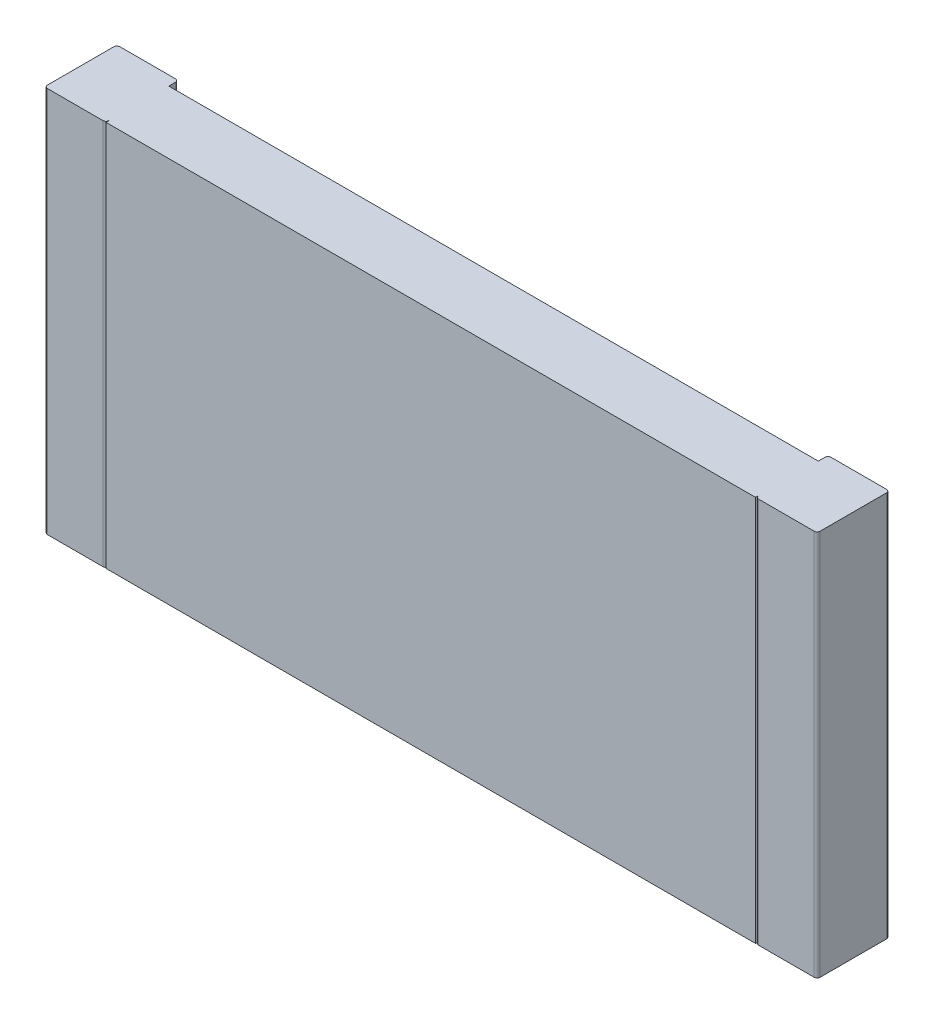
ISO-10303-21;
HEADER;
FILE_DESCRIPTION(('STEP AP214'),'2;1');
FILE_NAME('part.step','',(''),(''),'','','');
FILE_SCHEMA(('AUTOMOTIVE_DESIGN { 1 0 10303 214 1 1 1 1 }'));
ENDSEC;
DATA;
#1=APPLICATION_CONTEXT('core data for automotive mechanical design processes');
#2=APPLICATION_PROTOCOL_DEFINITION('international standard','automotive_design',2000,#1);
#3=PRODUCT_CONTEXT('',#1,'mechanical');
#4=PRODUCT('Part','Part','',(#3));
#5=PRODUCT_RELATED_PRODUCT_CATEGORY('part','',(#4));
#6=PRODUCT_DEFINITION_FORMATION('','',#4);
#7=PRODUCT_DEFINITION_CONTEXT('part definition',#1,'design');
#8=PRODUCT_DEFINITION('design','',#6,#7);
#9=PRODUCT_DEFINITION_SHAPE('','',#8);
#10=(LENGTH_UNIT() NAMED_UNIT(*) SI_UNIT(.MILLI.,.METRE.));
#11=(NAMED_UNIT(*) PLANE_ANGLE_UNIT() SI_UNIT($,.RADIAN.));
#12=(NAMED_UNIT(*) SI_UNIT($,.STERADIAN.) SOLID_ANGLE_UNIT());
#13=UNCERTAINTY_MEASURE_WITH_UNIT(LENGTH_MEASURE(1.E-05),#10,'distance_accuracy_value','');
#14=(GEOMETRIC_REPRESENTATION_CONTEXT(3) GLOBAL_UNCERTAINTY_ASSIGNED_CONTEXT((#13)) GLOBAL_UNIT_ASSIGNED_CONTEXT((#10,
#11,#12)) REPRESENTATION_CONTEXT('',''));
#15=CARTESIAN_POINT('',(0.,0.,0.));
#16=DIRECTION('',(0.,0.,1.));
#17=DIRECTION('',(1.,0.,0.));
#18=AXIS2_PLACEMENT_3D('',#15,#16,#17);
#19=CARTESIAN_POINT('',(-3.175,-1.6,0.575));
#20=DIRECTION('',(0.,1.,0.));
#21=DIRECTION('',(0.,0.,1.));
#22=AXIS2_PLACEMENT_3D('',#19,#20,#21);
#23=CYLINDRICAL_SURFACE('',#22,0.025);
#24=CARTESIAN_POINT('',(-3.175,1.6,0.575));
#25=DIRECTION('',(0.,1.,0.));
#26=DIRECTION('',(0.,0.,1.));
#27=AXIS2_PLACEMENT_3D('',#24,#25,#26);
#28=CIRCLE('',#27,0.025);
#29=CARTESIAN_POINT('',(-3.175,1.6,0.6));
#30=VERTEX_POINT('',#29);
#31=CARTESIAN_POINT('',(-3.2,1.6,0.575));
#32=VERTEX_POINT('',#31);
#33=EDGE_CURVE('E172',#30,#32,#28,.F.);
#34=ORIENTED_EDGE('',*,*,#33,.T.);
#35=DIRECTION('',(0.,1.,0.));
#36=VECTOR('',#35,1.);
#37=CARTESIAN_POINT('',(-3.2,-1.6,0.575));
#38=LINE('',#37,#36);
#39=CARTESIAN_POINT('',(-3.2,-1.6,0.575));
#40=VERTEX_POINT('',#39);
#41=EDGE_CURVE('E154',#32,#40,#38,.F.);
#42=ORIENTED_EDGE('',*,*,#41,.T.);
#43=CARTESIAN_POINT('',(-3.175,-1.6,0.575));
#44=DIRECTION('',(0.,1.,0.));
#45=DIRECTION('',(0.,0.,1.));
#46=AXIS2_PLACEMENT_3D('',#43,#44,#45);
#47=CIRCLE('',#46,0.025);
#48=CARTESIAN_POINT('',(-3.175,-1.6,0.6));
#49=VERTEX_POINT('',#48);
#50=EDGE_CURVE('E20',#40,#49,#47,.T.);
#51=ORIENTED_EDGE('',*,*,#50,.T.);
#52=DIRECTION('',(0.,1.,0.));
#53=VECTOR('',#52,1.);
#54=CARTESIAN_POINT('',(-3.175,-1.6,0.6));
#55=LINE('',#54,#53);
#56=EDGE_CURVE('E186',#30,#49,#55,.F.);
#57=ORIENTED_EDGE('',*,*,#56,.F.);
#58=EDGE_LOOP('',(#34,#42,#51,#57));
#59=FACE_BOUND('',#58,.T.);
#60=ADVANCED_FACE('F17',(#59),#23,.T.);
#61=CARTESIAN_POINT('',(3.175,-1.6,0.575));
#62=DIRECTION('',(0.,1.,0.));
#63=DIRECTION('',(0.,0.,1.));
#64=AXIS2_PLACEMENT_3D('',#61,#62,#63);
#65=CYLINDRICAL_SURFACE('',#64,0.025);
#66=DIRECTION('',(0.,1.,0.));
#67=VECTOR('',#66,1.);
#68=CARTESIAN_POINT('',(3.175,-1.6,0.6));
#69=LINE('',#68,#67);
#70=CARTESIAN_POINT('',(3.175,-1.6,0.6));
#71=VERTEX_POINT('',#70);
#72=CARTESIAN_POINT('',(3.175,1.6,0.6));
#73=VERTEX_POINT('',#72);
#74=EDGE_CURVE('E161',#71,#73,#69,.T.);
#75=ORIENTED_EDGE('',*,*,#74,.F.);
#76=CARTESIAN_POINT('',(3.175,-1.6,0.575));
#77=DIRECTION('',(0.,1.,0.));
#78=DIRECTION('',(0.,0.,1.));
#79=AXIS2_PLACEMENT_3D('',#76,#77,#78);
#80=CIRCLE('',#79,0.025);
#81=CARTESIAN_POINT('',(3.2,-1.6,0.575));
#82=VERTEX_POINT('',#81);
#83=EDGE_CURVE('E223',#71,#82,#80,.T.);
#84=ORIENTED_EDGE('',*,*,#83,.T.);
#85=DIRECTION('',(0.,1.,0.));
#86=VECTOR('',#85,1.);
#87=CARTESIAN_POINT('',(3.2,-1.6,0.575));
#88=LINE('',#87,#86);
#89=CARTESIAN_POINT('',(3.2,1.6,0.575));
#90=VERTEX_POINT('',#89);
#91=EDGE_CURVE('E181',#90,#82,#88,.F.);
#92=ORIENTED_EDGE('',*,*,#91,.F.);
#93=CARTESIAN_POINT('',(3.175,1.6,0.575));
#94=DIRECTION('',(0.,1.,0.));
#95=DIRECTION('',(0.,0.,1.));
#96=AXIS2_PLACEMENT_3D('',#93,#94,#95);
#97=CIRCLE('',#96,0.025);
#98=EDGE_CURVE('E225',#90,#73,#97,.F.);
#99=ORIENTED_EDGE('',*,*,#98,.T.);
#100=EDGE_LOOP('',(#75,#84,#92,#99));
#101=FACE_BOUND('',#100,.T.);
#102=ADVANCED_FACE('F230',(#101),#65,.T.);
#103=CARTESIAN_POINT('',(-3.2,-1.6,0.6));
#104=DIRECTION('',(0.,0.,1.));
#105=DIRECTION('',(1.,0.,0.));
#106=AXIS2_PLACEMENT_3D('',#103,#104,#105);
#107=PLANE('',#106);
#108=DIRECTION('',(1.,0.,0.));
#109=VECTOR('',#108,1.);
#110=CARTESIAN_POINT('',(-3.2,-1.6,0.6));
#111=LINE('',#110,#109);
#112=CARTESIAN_POINT('',(-2.715,-1.6,0.6));
#113=VERTEX_POINT('',#112);
#114=EDGE_CURVE('E168',#49,#113,#111,.T.);
#115=ORIENTED_EDGE('',*,*,#114,.T.);
#116=DIRECTION('',(0.,1.,0.));
#117=VECTOR('',#116,1.);
#118=CARTESIAN_POINT('',(-2.715,-1.6,0.6));
#119=LINE('',#118,#117);
#120=CARTESIAN_POINT('',(-2.715,1.6,0.6));
#121=VERTEX_POINT('',#120);
#122=EDGE_CURVE('E220',#121,#113,#119,.F.);
#123=ORIENTED_EDGE('',*,*,#122,.F.);
#124=DIRECTION('',(1.,0.,0.));
#125=VECTOR('',#124,1.);
#126=CARTESIAN_POINT('',(-3.2,1.6,0.6));
#127=LINE('',#126,#125);
#128=EDGE_CURVE('E188',#121,#30,#127,.F.);
#129=ORIENTED_EDGE('',*,*,#128,.T.);
#130=ORIENTED_EDGE('',*,*,#56,.T.);
#131=EDGE_LOOP('',(#115,#123,#129,#130));
#132=FACE_BOUND('',#131,.T.);
#133=ADVANCED_FACE('F253',(#132),#107,.T.);
#134=CARTESIAN_POINT('',(2.69,-1.6,0.6));
#135=DIRECTION('',(0.,0.,1.));
#136=DIRECTION('',(1.,0.,0.));
#137=AXIS2_PLACEMENT_3D('',#134,#135,#136);
#138=PLANE('',#137);
#139=DIRECTION('',(1.,0.,0.));
#140=VECTOR('',#139,1.);
#141=CARTESIAN_POINT('',(2.69,-1.6,0.6));
#142=LINE('',#141,#140);
#143=CARTESIAN_POINT('',(2.715,-1.6,0.6));
#144=VERTEX_POINT('',#143);
#145=EDGE_CURVE('E185',#144,#71,#142,.T.);
#146=ORIENTED_EDGE('',*,*,#145,.T.);
#147=ORIENTED_EDGE('',*,*,#74,.T.);
#148=DIRECTION('',(1.,0.,0.));
#149=VECTOR('',#148,1.);
#150=CARTESIAN_POINT('',(2.69,1.6,0.6));
#151=LINE('',#150,#149);
#152=CARTESIAN_POINT('',(2.715,1.6,0.6));
#153=VERTEX_POINT('',#152);
#154=EDGE_CURVE('E237',#73,#153,#151,.F.);
#155=ORIENTED_EDGE('',*,*,#154,.T.);
#156=DIRECTION('',(0.,1.,0.));
#157=VECTOR('',#156,1.);
#158=CARTESIAN_POINT('',(2.715,-1.6,0.6));
#159=LINE('',#158,#157);
#160=EDGE_CURVE('E215',#144,#153,#159,.T.);
#161=ORIENTED_EDGE('',*,*,#160,.F.);
#162=EDGE_LOOP('',(#146,#147,#155,#161));
#163=FACE_BOUND('',#162,.T.);
#164=ADVANCED_FACE('F235',(#163),#138,.T.);
#165=CARTESIAN_POINT('',(-3.2,-1.6,0.));
#166=DIRECTION('',(1.,0.,0.));
#167=DIRECTION('',(0.,0.,-1.));
#168=AXIS2_PLACEMENT_3D('',#165,#166,#167);
#169=PLANE('',#168);
#170=DIRECTION('',(0.,0.,-1.));
#171=VECTOR('',#170,1.);
#172=CARTESIAN_POINT('',(-3.2,1.6,0.));
#173=LINE('',#172,#171);
#174=CARTESIAN_POINT('',(-3.2,1.6,0.025));
#175=VERTEX_POINT('',#174);
#176=EDGE_CURVE('E160',#175,#32,#173,.F.);
#177=ORIENTED_EDGE('',*,*,#176,.F.);
#178=DIRECTION('',(0.,1.,0.));
#179=VECTOR('',#178,1.);
#180=CARTESIAN_POINT('',(-3.2,-1.6,0.025));
#181=LINE('',#180,#179);
#182=CARTESIAN_POINT('',(-3.2,-1.6,0.025));
#183=VERTEX_POINT('',#182);
#184=EDGE_CURVE('E157',#183,#175,#181,.T.);
#185=ORIENTED_EDGE('',*,*,#184,.F.);
#186=DIRECTION('',(0.,0.,-1.));
#187=VECTOR('',#186,1.);
#188=CARTESIAN_POINT('',(-3.2,-1.6,0.));
#189=LINE('',#188,#187);
#190=EDGE_CURVE('E150',#40,#183,#189,.T.);
#191=ORIENTED_EDGE('',*,*,#190,.F.);
#192=ORIENTED_EDGE('',*,*,#41,.F.);
#193=EDGE_LOOP('',(#177,#185,#191,#192));
#194=FACE_BOUND('',#193,.T.);
#195=ADVANCED_FACE('F152',(#194),#169,.F.);
#196=CARTESIAN_POINT('',(3.2,-1.6,0.));
#197=DIRECTION('',(1.,0.,0.));
#198=DIRECTION('',(0.,0.,-1.));
#199=AXIS2_PLACEMENT_3D('',#196,#197,#198);
#200=PLANE('',#199);
#201=DIRECTION('',(0.,0.,-1.));
#202=VECTOR('',#201,1.);
#203=CARTESIAN_POINT('',(3.2,1.6,0.));
#204=LINE('',#203,#202);
#205=CARTESIAN_POINT('',(3.2,1.6,0.025));
#206=VERTEX_POINT('',#205);
#207=EDGE_CURVE('E176',#206,#90,#204,.F.);
#208=ORIENTED_EDGE('',*,*,#207,.T.);
#209=ORIENTED_EDGE('',*,*,#91,.T.);
#210=DIRECTION('',(0.,0.,-1.));
#211=VECTOR('',#210,1.);
#212=CARTESIAN_POINT('',(3.2,-1.6,0.));
#213=LINE('',#212,#211);
#214=CARTESIAN_POINT('',(3.2,-1.6,0.025));
#215=VERTEX_POINT('',#214);
#216=EDGE_CURVE('E174',#82,#215,#213,.T.);
#217=ORIENTED_EDGE('',*,*,#216,.T.);
#218=DIRECTION('',(0.,1.,0.));
#219=VECTOR('',#218,1.);
#220=CARTESIAN_POINT('',(3.2,-1.6,0.025));
#221=LINE('',#220,#219);
#222=EDGE_CURVE('E206',#206,#215,#221,.F.);
#223=ORIENTED_EDGE('',*,*,#222,.F.);
#224=EDGE_LOOP('',(#208,#209,#217,#223));
#225=FACE_BOUND('',#224,.T.);
#226=ADVANCED_FACE('F432',(#225),#200,.T.);
#227=CARTESIAN_POINT('',(-2.715,-1.6,0.575));
#228=DIRECTION('',(0.,1.,0.));
#229=DIRECTION('',(0.,0.,1.));
#230=AXIS2_PLACEMENT_3D('',#227,#228,#229);
#231=CYLINDRICAL_SURFACE('',#230,0.025);
#232=ORIENTED_EDGE('',*,*,#122,.T.);
#233=CARTESIAN_POINT('',(-2.715,-1.6,0.575));
#234=DIRECTION('',(0.,1.,0.));
#235=DIRECTION('',(0.,0.,1.));
#236=AXIS2_PLACEMENT_3D('',#233,#234,#235);
#237=CIRCLE('',#236,0.025);
#238=CARTESIAN_POINT('',(-2.69,-1.6,0.575));
#239=VERTEX_POINT('',#238);
#240=EDGE_CURVE('E218',#113,#239,#237,.T.);
#241=ORIENTED_EDGE('',*,*,#240,.T.);
#242=DIRECTION('',(0.,1.,0.));
#243=VECTOR('',#242,1.);
#244=CARTESIAN_POINT('',(-2.69,-1.6,0.575));
#245=LINE('',#244,#243);
#246=CARTESIAN_POINT('',(-2.69,1.6,0.575));
#247=VERTEX_POINT('',#246);
#248=EDGE_CURVE('E269',#239,#247,#245,.T.);
#249=ORIENTED_EDGE('',*,*,#248,.T.);
#250=CARTESIAN_POINT('',(-2.715,1.6,0.575));
#251=DIRECTION('',(0.,1.,0.));
#252=DIRECTION('',(0.,0.,1.));
#253=AXIS2_PLACEMENT_3D('',#250,#251,#252);
#254=CIRCLE('',#253,0.025);
#255=EDGE_CURVE('E221',#247,#121,#254,.F.);
#256=ORIENTED_EDGE('',*,*,#255,.T.);
#257=EDGE_LOOP('',(#232,#241,#249,#256));
#258=FACE_BOUND('',#257,.T.);
#259=ADVANCED_FACE('F450',(#258),#231,.T.);
#260=CARTESIAN_POINT('',(2.715,-1.6,0.575));
#261=DIRECTION('',(0.,1.,0.));
#262=DIRECTION('',(0.,0.,1.));
#263=AXIS2_PLACEMENT_3D('',#260,#261,#262);
#264=CYLINDRICAL_SURFACE('',#263,0.025);
#265=CARTESIAN_POINT('',(2.715,1.6,0.575));
#266=DIRECTION('',(0.,1.,0.));
#267=DIRECTION('',(0.,0.,1.));
#268=AXIS2_PLACEMENT_3D('',#265,#266,#267);
#269=CIRCLE('',#268,0.025);
#270=CARTESIAN_POINT('',(2.69,1.6,0.575));
#271=VERTEX_POINT('',#270);
#272=EDGE_CURVE('E213',#153,#271,#269,.F.);
#273=ORIENTED_EDGE('',*,*,#272,.T.);
#274=DIRECTION('',(0.,1.,0.));
#275=VECTOR('',#274,1.);
#276=CARTESIAN_POINT('',(2.69,-1.6,0.575));
#277=LINE('',#276,#275);
#278=CARTESIAN_POINT('',(2.69,-1.6,0.575));
#279=VERTEX_POINT('',#278);
#280=EDGE_CURVE('E292',#279,#271,#277,.T.);
#281=ORIENTED_EDGE('',*,*,#280,.F.);
#282=CARTESIAN_POINT('',(2.715,-1.6,0.575));
#283=DIRECTION('',(0.,1.,0.));
#284=DIRECTION('',(0.,0.,1.));
#285=AXIS2_PLACEMENT_3D('',#282,#283,#284);
#286=CIRCLE('',#285,0.025);
#287=EDGE_CURVE('E216',#279,#144,#286,.T.);
#288=ORIENTED_EDGE('',*,*,#287,.T.);
#289=ORIENTED_EDGE('',*,*,#160,.T.);
#290=EDGE_LOOP('',(#273,#281,#288,#289));
#291=FACE_BOUND('',#290,.T.);
#292=ADVANCED_FACE('F428',(#291),#264,.T.);
#293=CARTESIAN_POINT('',(-3.175,-1.6,0.025));
#294=DIRECTION('',(0.,1.,0.));
#295=DIRECTION('',(0.,0.,1.));
#296=AXIS2_PLACEMENT_3D('',#293,#294,#295);
#297=CYLINDRICAL_SURFACE('',#296,0.025);
#298=DIRECTION('',(0.,1.,0.));
#299=VECTOR('',#298,1.);
#300=CARTESIAN_POINT('',(-3.175,-1.6,0.));
#301=LINE('',#300,#299);
#302=CARTESIAN_POINT('',(-3.175,1.6,0.));
#303=VERTEX_POINT('',#302);
#304=CARTESIAN_POINT('',(-3.175,-1.6,0.));
#305=VERTEX_POINT('',#304);
#306=EDGE_CURVE('E308',#303,#305,#301,.F.);
#307=ORIENTED_EDGE('',*,*,#306,.T.);
#308=CARTESIAN_POINT('',(-3.175,-1.6,0.025));
#309=DIRECTION('',(0.,1.,0.));
#310=DIRECTION('',(0.,0.,1.));
#311=AXIS2_PLACEMENT_3D('',#308,#309,#310);
#312=CIRCLE('',#311,0.025);
#313=EDGE_CURVE('E209',#305,#183,#312,.T.);
#314=ORIENTED_EDGE('',*,*,#313,.T.);
#315=ORIENTED_EDGE('',*,*,#184,.T.);
#316=CARTESIAN_POINT('',(-3.175,1.6,0.025));
#317=DIRECTION('',(0.,1.,0.));
#318=DIRECTION('',(0.,0.,1.));
#319=AXIS2_PLACEMENT_3D('',#316,#317,#318);
#320=CIRCLE('',#319,0.025);
#321=EDGE_CURVE('E211',#175,#303,#320,.F.);
#322=ORIENTED_EDGE('',*,*,#321,.T.);
#323=EDGE_LOOP('',(#307,#314,#315,#322));
#324=FACE_BOUND('',#323,.T.);
#325=ADVANCED_FACE('F258',(#324),#297,.T.);
#326=CARTESIAN_POINT('',(3.175,-1.6,0.025));
#327=DIRECTION('',(0.,1.,0.));
#328=DIRECTION('',(0.,0.,1.));
#329=AXIS2_PLACEMENT_3D('',#326,#327,#328);
#330=CYLINDRICAL_SURFACE('',#329,0.025);
#331=CARTESIAN_POINT('',(3.175,1.6,0.025));
#332=DIRECTION('',(0.,1.,0.));
#333=DIRECTION('',(0.,0.,1.));
#334=AXIS2_PLACEMENT_3D('',#331,#332,#333);
#335=CIRCLE('',#334,0.025);
#336=CARTESIAN_POINT('',(3.175,1.6,0.));
#337=VERTEX_POINT('',#336);
#338=EDGE_CURVE('E204',#337,#206,#335,.F.);
#339=ORIENTED_EDGE('',*,*,#338,.T.);
#340=ORIENTED_EDGE('',*,*,#222,.T.);
#341=CARTESIAN_POINT('',(3.175,-1.6,0.025));
#342=DIRECTION('',(0.,1.,0.));
#343=DIRECTION('',(0.,0.,1.));
#344=AXIS2_PLACEMENT_3D('',#341,#342,#343);
#345=CIRCLE('',#344,0.025);
#346=CARTESIAN_POINT('',(3.175,-1.6,0.));
#347=VERTEX_POINT('',#346);
#348=EDGE_CURVE('E207',#215,#347,#345,.T.);
#349=ORIENTED_EDGE('',*,*,#348,.T.);
#350=DIRECTION('',(0.,1.,0.));
#351=VECTOR('',#350,1.);
#352=CARTESIAN_POINT('',(3.175,-1.6,0.));
#353=LINE('',#352,#351);
#354=EDGE_CURVE('E276',#347,#337,#353,.T.);
#355=ORIENTED_EDGE('',*,*,#354,.T.);
#356=EDGE_LOOP('',(#339,#340,#349,#355));
#357=FACE_BOUND('',#356,.T.);
#358=ADVANCED_FACE('F438',(#357),#330,.T.);
#359=CARTESIAN_POINT('',(-2.69,-1.6,0.52));
#360=DIRECTION('',(1.,0.,0.));
#361=DIRECTION('',(0.,0.,-1.));
#362=AXIS2_PLACEMENT_3D('',#359,#360,#361);
#363=PLANE('',#362);
#364=DIRECTION('',(0.,0.,-1.));
#365=VECTOR('',#364,1.);
#366=CARTESIAN_POINT('',(-2.69,1.6,0.52));
#367=LINE('',#366,#365);
#368=CARTESIAN_POINT('',(-2.69,1.6,0.6));
#369=VERTEX_POINT('',#368);
#370=EDGE_CURVE('E279',#247,#369,#367,.F.);
#371=ORIENTED_EDGE('',*,*,#370,.F.);
#372=ORIENTED_EDGE('',*,*,#248,.F.);
#373=DIRECTION('',(0.,0.,-1.));
#374=VECTOR('',#373,1.);
#375=CARTESIAN_POINT('',(-2.69,-1.6,0.52));
#376=LINE('',#375,#374);
#377=CARTESIAN_POINT('',(-2.69,-1.6,0.6));
#378=VERTEX_POINT('',#377);
#379=EDGE_CURVE('E264',#378,#239,#376,.T.);
#380=ORIENTED_EDGE('',*,*,#379,.F.);
#381=DIRECTION('',(0.,1.,0.));
#382=VECTOR('',#381,1.);
#383=CARTESIAN_POINT('',(-2.69,-1.6,0.6));
#384=LINE('',#383,#382);
#385=EDGE_CURVE('E272',#369,#378,#384,.F.);
#386=ORIENTED_EDGE('',*,*,#385,.F.);
#387=EDGE_LOOP('',(#371,#372,#380,#386));
#388=FACE_BOUND('',#387,.T.);
#389=ADVANCED_FACE('F394',(#388),#363,.F.);
#390=CARTESIAN_POINT('',(2.69,-1.6,0.52));
#391=DIRECTION('',(1.,0.,0.));
#392=DIRECTION('',(0.,0.,-1.));
#393=AXIS2_PLACEMENT_3D('',#390,#391,#392);
#394=PLANE('',#393);
#395=DIRECTION('',(0.,0.,-1.));
#396=VECTOR('',#395,1.);
#397=CARTESIAN_POINT('',(2.69,1.6,0.52));
#398=LINE('',#397,#396);
#399=CARTESIAN_POINT('',(2.69,1.6,0.6));
#400=VERTEX_POINT('',#399);
#401=EDGE_CURVE('E303',#271,#400,#398,.F.);
#402=ORIENTED_EDGE('',*,*,#401,.T.);
#403=DIRECTION('',(0.,1.,0.));
#404=VECTOR('',#403,1.);
#405=CARTESIAN_POINT('',(2.69,-1.6,0.6));
#406=LINE('',#405,#404);
#407=CARTESIAN_POINT('',(2.69,-1.6,0.6));
#408=VERTEX_POINT('',#407);
#409=EDGE_CURVE('E275',#408,#400,#406,.T.);
#410=ORIENTED_EDGE('',*,*,#409,.F.);
#411=DIRECTION('',(0.,0.,-1.));
#412=VECTOR('',#411,1.);
#413=CARTESIAN_POINT('',(2.69,-1.6,0.52));
#414=LINE('',#413,#412);
#415=EDGE_CURVE('E281',#408,#279,#414,.T.);
#416=ORIENTED_EDGE('',*,*,#415,.T.);
#417=ORIENTED_EDGE('',*,*,#280,.T.);
#418=EDGE_LOOP('',(#402,#410,#416,#417));
#419=FACE_BOUND('',#418,.T.);
#420=ADVANCED_FACE('F384',(#419),#394,.T.);
#421=CARTESIAN_POINT('',(-3.2,-1.6,0.));
#422=DIRECTION('',(0.,0.,1.));
#423=DIRECTION('',(1.,0.,0.));
#424=AXIS2_PLACEMENT_3D('',#421,#422,#423);
#425=PLANE('',#424);
#426=DIRECTION('',(1.,0.,0.));
#427=VECTOR('',#426,1.);
#428=CARTESIAN_POINT('',(-3.2,-1.6,0.));
#429=LINE('',#428,#427);
#430=CARTESIAN_POINT('',(-2.715,-1.6,0.));
#431=VERTEX_POINT('',#430);
#432=EDGE_CURVE('E310',#305,#431,#429,.T.);
#433=ORIENTED_EDGE('',*,*,#432,.F.);
#434=ORIENTED_EDGE('',*,*,#306,.F.);
#435=DIRECTION('',(1.,0.,0.));
#436=VECTOR('',#435,1.);
#437=CARTESIAN_POINT('',(-3.2,1.6,0.));
#438=LINE('',#437,#436);
#439=CARTESIAN_POINT('',(-2.715,1.6,0.));
#440=VERTEX_POINT('',#439);
#441=EDGE_CURVE('E305',#440,#303,#438,.F.);
#442=ORIENTED_EDGE('',*,*,#441,.F.);
#443=DIRECTION('',(0.,1.,0.));
#444=VECTOR('',#443,1.);
#445=CARTESIAN_POINT('',(-2.715,-1.6,0.));
#446=LINE('',#445,#444);
#447=EDGE_CURVE('E203',#431,#440,#446,.T.);
#448=ORIENTED_EDGE('',*,*,#447,.F.);
#449=EDGE_LOOP('',(#433,#434,#442,#448));
#450=FACE_BOUND('',#449,.T.);
#451=ADVANCED_FACE('F381',(#450),#425,.F.);
#452=CARTESIAN_POINT('',(2.69,-1.6,0.));
#453=DIRECTION('',(0.,0.,1.));
#454=DIRECTION('',(1.,0.,0.));
#455=AXIS2_PLACEMENT_3D('',#452,#453,#454);
#456=PLANE('',#455);
#457=DIRECTION('',(1.,0.,0.));
#458=VECTOR('',#457,1.);
#459=CARTESIAN_POINT('',(2.69,-1.6,0.));
#460=LINE('',#459,#458);
#461=CARTESIAN_POINT('',(2.715,-1.6,0.));
#462=VERTEX_POINT('',#461);
#463=EDGE_CURVE('E288',#347,#462,#460,.F.);
#464=ORIENTED_EDGE('',*,*,#463,.T.);
#465=DIRECTION('',(0.,1.,0.));
#466=VECTOR('',#465,1.);
#467=CARTESIAN_POINT('',(2.715,-1.6,0.));
#468=LINE('',#467,#466);
#469=CARTESIAN_POINT('',(2.715,1.6,0.));
#470=VERTEX_POINT('',#469);
#471=EDGE_CURVE('E198',#470,#462,#468,.F.);
#472=ORIENTED_EDGE('',*,*,#471,.F.);
#473=DIRECTION('',(1.,0.,0.));
#474=VECTOR('',#473,1.);
#475=CARTESIAN_POINT('',(2.69,1.6,0.));
#476=LINE('',#475,#474);
#477=EDGE_CURVE('E313',#337,#470,#476,.F.);
#478=ORIENTED_EDGE('',*,*,#477,.F.);
#479=ORIENTED_EDGE('',*,*,#354,.F.);
#480=EDGE_LOOP('',(#464,#472,#478,#479));
#481=FACE_BOUND('',#480,.T.);
#482=ADVANCED_FACE('F383',(#481),#456,.F.);
#483=CARTESIAN_POINT('',(-2.69,-1.6,0.6));
#484=DIRECTION('',(0.,0.,1.));
#485=DIRECTION('',(1.,0.,0.));
#486=AXIS2_PLACEMENT_3D('',#483,#484,#485);
#487=PLANE('',#486);
#488=ORIENTED_EDGE('',*,*,#409,.T.);
#489=DIRECTION('',(1.,0.,0.));
#490=VECTOR('',#489,1.);
#491=CARTESIAN_POINT('',(-2.69,1.6,0.6));
#492=LINE('',#491,#490);
#493=EDGE_CURVE('E192',#369,#400,#492,.T.);
#494=ORIENTED_EDGE('',*,*,#493,.F.);
#495=ORIENTED_EDGE('',*,*,#385,.T.);
#496=DIRECTION('',(1.,0.,0.));
#497=VECTOR('',#496,1.);
#498=CARTESIAN_POINT('',(-2.69,-1.6,0.6));
#499=LINE('',#498,#497);
#500=EDGE_CURVE('E202',#378,#408,#499,.T.);
#501=ORIENTED_EDGE('',*,*,#500,.T.);
#502=EDGE_LOOP('',(#488,#494,#495,#501));
#503=FACE_BOUND('',#502,.T.);
#504=ADVANCED_FACE('F391',(#503),#487,.T.);
#505=CARTESIAN_POINT('',(-2.715,-1.6,0.025));
#506=DIRECTION('',(0.,1.,0.));
#507=DIRECTION('',(0.,0.,1.));
#508=AXIS2_PLACEMENT_3D('',#505,#506,#507);
#509=CYLINDRICAL_SURFACE('',#508,0.025);
#510=CARTESIAN_POINT('',(-2.715,1.6,0.025));
#511=DIRECTION('',(0.,1.,0.));
#512=DIRECTION('',(0.,0.,1.));
#513=AXIS2_PLACEMENT_3D('',#510,#511,#512);
#514=CIRCLE('',#513,0.025);
#515=CARTESIAN_POINT('',(-2.69,1.6,0.025));
#516=VERTEX_POINT('',#515);
#517=EDGE_CURVE('E193',#516,#440,#514,.T.);
#518=ORIENTED_EDGE('',*,*,#517,.F.);
#519=DIRECTION('',(0.,1.,0.));
#520=VECTOR('',#519,1.);
#521=CARTESIAN_POINT('',(-2.69,-1.6,0.025));
#522=LINE('',#521,#520);
#523=CARTESIAN_POINT('',(-2.69,-1.6,0.025));
#524=VERTEX_POINT('',#523);
#525=EDGE_CURVE('E325',#524,#516,#522,.T.);
#526=ORIENTED_EDGE('',*,*,#525,.F.);
#527=CARTESIAN_POINT('',(-2.715,-1.6,0.025));
#528=DIRECTION('',(0.,1.,0.));
#529=DIRECTION('',(0.,0.,1.));
#530=AXIS2_PLACEMENT_3D('',#527,#528,#529);
#531=CIRCLE('',#530,0.025);
#532=EDGE_CURVE('E199',#524,#431,#531,.T.);
#533=ORIENTED_EDGE('',*,*,#532,.T.);
#534=ORIENTED_EDGE('',*,*,#447,.T.);
#535=EDGE_LOOP('',(#518,#526,#533,#534));
#536=FACE_BOUND('',#535,.T.);
#537=ADVANCED_FACE('F377',(#536),#509,.T.);
#538=CARTESIAN_POINT('',(2.715,-1.6,0.025));
#539=DIRECTION('',(0.,1.,0.));
#540=DIRECTION('',(0.,0.,1.));
#541=AXIS2_PLACEMENT_3D('',#538,#539,#540);
#542=CYLINDRICAL_SURFACE('',#541,0.025);
#543=ORIENTED_EDGE('',*,*,#471,.T.);
#544=CARTESIAN_POINT('',(2.715,-1.6,0.025));
#545=DIRECTION('',(0.,1.,0.));
#546=DIRECTION('',(0.,0.,1.));
#547=AXIS2_PLACEMENT_3D('',#544,#545,#546);
#548=CIRCLE('',#547,0.025);
#549=CARTESIAN_POINT('',(2.69,-1.6,0.025));
#550=VERTEX_POINT('',#549);
#551=EDGE_CURVE('E196',#462,#550,#548,.T.);
#552=ORIENTED_EDGE('',*,*,#551,.T.);
#553=DIRECTION('',(0.,1.,0.));
#554=VECTOR('',#553,1.);
#555=CARTESIAN_POINT('',(2.69,-1.6,0.025));
#556=LINE('',#555,#554);
#557=CARTESIAN_POINT('',(2.69,1.6,0.025));
#558=VERTEX_POINT('',#557);
#559=EDGE_CURVE('E347',#550,#558,#556,.T.);
#560=ORIENTED_EDGE('',*,*,#559,.T.);
#561=CARTESIAN_POINT('',(2.715,1.6,0.025));
#562=DIRECTION('',(0.,1.,0.));
#563=DIRECTION('',(0.,0.,1.));
#564=AXIS2_PLACEMENT_3D('',#561,#562,#563);
#565=CIRCLE('',#564,0.025);
#566=EDGE_CURVE('E189',#470,#558,#565,.T.);
#567=ORIENTED_EDGE('',*,*,#566,.F.);
#568=EDGE_LOOP('',(#543,#552,#560,#567));
#569=FACE_BOUND('',#568,.T.);
#570=ADVANCED_FACE('F361',(#569),#542,.T.);
#571=CARTESIAN_POINT('',(-2.69,-1.6,0.));
#572=DIRECTION('',(1.,0.,0.));
#573=DIRECTION('',(0.,0.,-1.));
#574=AXIS2_PLACEMENT_3D('',#571,#572,#573);
#575=PLANE('',#574);
#576=DIRECTION('',(0.,0.,-1.));
#577=VECTOR('',#576,1.);
#578=CARTESIAN_POINT('',(-2.69,1.6,0.));
#579=LINE('',#578,#577);
#580=CARTESIAN_POINT('',(-2.69,1.6,0.08));
#581=VERTEX_POINT('',#580);
#582=EDGE_CURVE('E322',#516,#581,#579,.F.);
#583=ORIENTED_EDGE('',*,*,#582,.T.);
#584=DIRECTION('',(0.,1.,0.));
#585=VECTOR('',#584,1.);
#586=CARTESIAN_POINT('',(-2.69,-1.6,0.08));
#587=LINE('',#586,#585);
#588=CARTESIAN_POINT('',(-2.69,-1.6,0.08));
#589=VERTEX_POINT('',#588);
#590=EDGE_CURVE('E329',#581,#589,#587,.F.);
#591=ORIENTED_EDGE('',*,*,#590,.T.);
#592=DIRECTION('',(0.,0.,-1.));
#593=VECTOR('',#592,1.);
#594=CARTESIAN_POINT('',(-2.69,-1.6,0.));
#595=LINE('',#594,#593);
#596=EDGE_CURVE('E191',#589,#524,#595,.T.);
#597=ORIENTED_EDGE('',*,*,#596,.T.);
#598=ORIENTED_EDGE('',*,*,#525,.T.);
#599=EDGE_LOOP('',(#583,#591,#597,#598));
#600=FACE_BOUND('',#599,.T.);
#601=ADVANCED_FACE('F372',(#600),#575,.T.);
#602=CARTESIAN_POINT('',(-3.12,-1.6,0.08));
#603=DIRECTION('',(0.,1.,0.));
#604=DIRECTION('',(0.,0.,1.));
#605=AXIS2_PLACEMENT_3D('',#602,#603,#604);
#606=PLANE('',#605);
#607=ORIENTED_EDGE('',*,*,#379,.T.);
#608=ORIENTED_EDGE('',*,*,#240,.F.);
#609=ORIENTED_EDGE('',*,*,#114,.F.);
#610=ORIENTED_EDGE('',*,*,#50,.F.);
#611=ORIENTED_EDGE('',*,*,#190,.T.);
#612=ORIENTED_EDGE('',*,*,#313,.F.);
#613=ORIENTED_EDGE('',*,*,#432,.T.);
#614=ORIENTED_EDGE('',*,*,#532,.F.);
#615=ORIENTED_EDGE('',*,*,#596,.F.);
#616=DIRECTION('',(1.,0.,0.));
#617=VECTOR('',#616,1.);
#618=CARTESIAN_POINT('',(-3.12,-1.6,0.08));
#619=LINE('',#618,#617);
#620=CARTESIAN_POINT('',(2.69,-1.6,0.08));
#621=VERTEX_POINT('',#620);
#622=EDGE_CURVE('E332',#589,#621,#619,.T.);
#623=ORIENTED_EDGE('',*,*,#622,.T.);
#624=DIRECTION('',(0.,0.,-1.));
#625=VECTOR('',#624,1.);
#626=CARTESIAN_POINT('',(2.69,-1.6,0.));
#627=LINE('',#626,#625);
#628=EDGE_CURVE('E324',#621,#550,#627,.T.);
#629=ORIENTED_EDGE('',*,*,#628,.T.);
#630=ORIENTED_EDGE('',*,*,#551,.F.);
#631=ORIENTED_EDGE('',*,*,#463,.F.);
#632=ORIENTED_EDGE('',*,*,#348,.F.);
#633=ORIENTED_EDGE('',*,*,#216,.F.);
#634=ORIENTED_EDGE('',*,*,#83,.F.);
#635=ORIENTED_EDGE('',*,*,#145,.F.);
#636=ORIENTED_EDGE('',*,*,#287,.F.);
#637=ORIENTED_EDGE('',*,*,#415,.F.);
#638=ORIENTED_EDGE('',*,*,#500,.F.);
#639=EDGE_LOOP('',(#607,#608,#609,#610,#611,#612,#613,#614,#615,#623,#629,#630,#631,#632,#633,
#634,#635,#636,#637,#638));
#640=FACE_BOUND('',#639,.T.);
#641=ADVANCED_FACE('F166',(#640),#606,.F.);
#642=CARTESIAN_POINT('',(2.69,-1.6,0.));
#643=DIRECTION('',(1.,0.,0.));
#644=DIRECTION('',(0.,0.,-1.));
#645=AXIS2_PLACEMENT_3D('',#642,#643,#644);
#646=PLANE('',#645);
#647=DIRECTION('',(0.,0.,-1.));
#648=VECTOR('',#647,1.);
#649=CARTESIAN_POINT('',(2.69,1.6,0.));
#650=LINE('',#649,#648);
#651=CARTESIAN_POINT('',(2.69,1.6,0.08));
#652=VERTEX_POINT('',#651);
#653=EDGE_CURVE('E34',#558,#652,#650,.F.);
#654=ORIENTED_EDGE('',*,*,#653,.F.);
#655=ORIENTED_EDGE('',*,*,#559,.F.);
#656=ORIENTED_EDGE('',*,*,#628,.F.);
#657=DIRECTION('',(0.,1.,0.));
#658=VECTOR('',#657,1.);
#659=CARTESIAN_POINT('',(2.69,-1.6,0.08));
#660=LINE('',#659,#658);
#661=EDGE_CURVE('E26',#621,#652,#660,.T.);
#662=ORIENTED_EDGE('',*,*,#661,.T.);
#663=EDGE_LOOP('',(#654,#655,#656,#662));
#664=FACE_BOUND('',#663,.T.);
#665=ADVANCED_FACE('F364',(#664),#646,.F.);
#666=CARTESIAN_POINT('',(-3.12,1.6,0.08));
#667=DIRECTION('',(0.,1.,0.));
#668=DIRECTION('',(0.,0.,1.));
#669=AXIS2_PLACEMENT_3D('',#666,#667,#668);
#670=PLANE('',#669);
#671=ORIENTED_EDGE('',*,*,#255,.F.);
#672=ORIENTED_EDGE('',*,*,#370,.T.);
#673=ORIENTED_EDGE('',*,*,#493,.T.);
#674=ORIENTED_EDGE('',*,*,#401,.F.);
#675=ORIENTED_EDGE('',*,*,#272,.F.);
#676=ORIENTED_EDGE('',*,*,#154,.F.);
#677=ORIENTED_EDGE('',*,*,#98,.F.);
#678=ORIENTED_EDGE('',*,*,#207,.F.);
#679=ORIENTED_EDGE('',*,*,#338,.F.);
#680=ORIENTED_EDGE('',*,*,#477,.T.);
#681=ORIENTED_EDGE('',*,*,#566,.T.);
#682=ORIENTED_EDGE('',*,*,#653,.T.);
#683=DIRECTION('',(1.,0.,0.));
#684=VECTOR('',#683,1.);
#685=CARTESIAN_POINT('',(-3.12,1.6,0.08));
#686=LINE('',#685,#684);
#687=EDGE_CURVE('E11',#652,#581,#686,.F.);
#688=ORIENTED_EDGE('',*,*,#687,.T.);
#689=ORIENTED_EDGE('',*,*,#582,.F.);
#690=ORIENTED_EDGE('',*,*,#517,.T.);
#691=ORIENTED_EDGE('',*,*,#441,.T.);
#692=ORIENTED_EDGE('',*,*,#321,.F.);
#693=ORIENTED_EDGE('',*,*,#176,.T.);
#694=ORIENTED_EDGE('',*,*,#33,.F.);
#695=ORIENTED_EDGE('',*,*,#128,.F.);
#696=EDGE_LOOP('',(#671,#672,#673,#674,#675,#676,#677,#678,#679,#680,#681,#682,#688,#689,#690,
#691,#692,#693,#694,#695));
#697=FACE_BOUND('',#696,.T.);
#698=ADVANCED_FACE('F242',(#697),#670,.T.);
#699=CARTESIAN_POINT('',(-3.12,-1.6,0.08));
#700=DIRECTION('',(0.,0.,1.));
#701=DIRECTION('',(1.,0.,0.));
#702=AXIS2_PLACEMENT_3D('',#699,#700,#701);
#703=PLANE('',#702);
#704=ORIENTED_EDGE('',*,*,#661,.F.);
#705=ORIENTED_EDGE('',*,*,#622,.F.);
#706=ORIENTED_EDGE('',*,*,#590,.F.);
#707=ORIENTED_EDGE('',*,*,#687,.F.);
#708=EDGE_LOOP('',(#704,#705,#706,#707));
#709=FACE_BOUND('',#708,.T.);
#710=ADVANCED_FACE('F370',(#709),#703,.F.);
#711=CLOSED_SHELL('',(#60,#102,#133,#164,#195,#226,#259,#292,#325,#358,#389,#420,#451,#482,#504,
#537,#570,#601,#641,#665,#698,#710));
#712=MANIFOLD_SOLID_BREP('B1',#711);
#713=ADVANCED_BREP_SHAPE_REPRESENTATION('',(#18,#712),#14);
#714=SHAPE_DEFINITION_REPRESENTATION(#9,#713);
ENDSEC;
END-ISO-10303-21;
